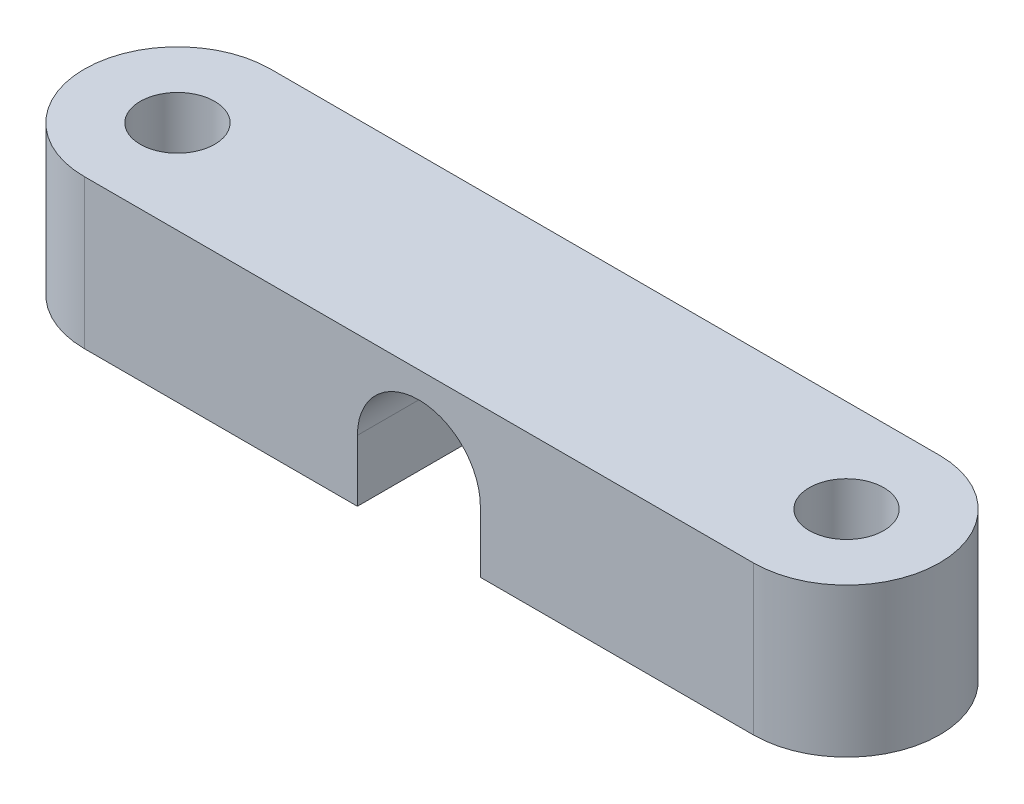
ISO-10303-21;
HEADER;
FILE_DESCRIPTION(('STEP AP214'),'2;1');
FILE_NAME('part.step','',(''),(''),'','','');
FILE_SCHEMA(('AUTOMOTIVE_DESIGN { 1 0 10303 214 1 1 1 1 }'));
ENDSEC;
DATA;
#1=APPLICATION_CONTEXT('core data for automotive mechanical design processes');
#2=APPLICATION_PROTOCOL_DEFINITION('international standard','automotive_design',2000,#1);
#3=PRODUCT_CONTEXT('',#1,'mechanical');
#4=PRODUCT('Part','Part','',(#3));
#5=PRODUCT_RELATED_PRODUCT_CATEGORY('part','',(#4));
#6=PRODUCT_DEFINITION_FORMATION('','',#4);
#7=PRODUCT_DEFINITION_CONTEXT('part definition',#1,'design');
#8=PRODUCT_DEFINITION('design','',#6,#7);
#9=PRODUCT_DEFINITION_SHAPE('','',#8);
#10=(LENGTH_UNIT() NAMED_UNIT(*) SI_UNIT(.MILLI.,.METRE.));
#11=(NAMED_UNIT(*) PLANE_ANGLE_UNIT() SI_UNIT($,.RADIAN.));
#12=(NAMED_UNIT(*) SI_UNIT($,.STERADIAN.) SOLID_ANGLE_UNIT());
#13=UNCERTAINTY_MEASURE_WITH_UNIT(LENGTH_MEASURE(1.E-05),#10,'distance_accuracy_value','');
#14=(GEOMETRIC_REPRESENTATION_CONTEXT(3) GLOBAL_UNCERTAINTY_ASSIGNED_CONTEXT((#13)) GLOBAL_UNIT_ASSIGNED_CONTEXT((#10,
#11,#12)) REPRESENTATION_CONTEXT('',''));
#15=CARTESIAN_POINT('',(0.,0.,0.));
#16=DIRECTION('',(0.,0.,1.));
#17=DIRECTION('',(1.,0.,0.));
#18=AXIS2_PLACEMENT_3D('',#15,#16,#17);
#19=CARTESIAN_POINT('',(-17.9605122421383,0.,-17.9605122421383));
#20=DIRECTION('',(0.,1.,0.));
#21=DIRECTION('',(0.,0.,1.));
#22=AXIS2_PLACEMENT_3D('',#19,#20,#21);
#23=PLANE('',#22);
#24=CARTESIAN_POINT('',(17.9605122421383,0.,-17.9605122421383));
#25=DIRECTION('',(0.,1.,0.));
#26=DIRECTION('',(0.,0.,1.));
#27=AXIS2_PLACEMENT_3D('',#24,#25,#26);
#28=CIRCLE('',#27,2.);
#29=CARTESIAN_POINT('',(17.9605122421383,0.,-15.9605122421383));
#30=VERTEX_POINT('',#29);
#31=EDGE_CURVE('E161',#30,#30,#28,.T.);
#32=ORIENTED_EDGE('',*,*,#31,.T.);
#33=EDGE_LOOP('',(#32));
#34=FACE_BOUND('',#33,.T.);
#35=DIRECTION('',(0.,0.,1.));
#36=VECTOR('',#35,1.);
#37=CARTESIAN_POINT('',(3.29999999999998,0.,-22.9605122421383));
#38=LINE('',#37,#36);
#39=CARTESIAN_POINT('',(3.29999999999998,0.,-22.9605122421383));
#40=VERTEX_POINT('',#39);
#41=CARTESIAN_POINT('',(3.29999999999998,0.,-12.9605122421383));
#42=VERTEX_POINT('',#41);
#43=EDGE_CURVE('E112',#40,#42,#38,.T.);
#44=ORIENTED_EDGE('',*,*,#43,.F.);
#45=DIRECTION('',(-1.,0.,0.));
#46=VECTOR('',#45,1.);
#47=CARTESIAN_POINT('',(-17.9605122421383,0.,-22.9605122421383));
#48=LINE('',#47,#46);
#49=CARTESIAN_POINT('',(17.9605122421383,0.,-22.9605122421383));
#50=VERTEX_POINT('',#49);
#51=EDGE_CURVE('E122',#50,#40,#48,.T.);
#52=ORIENTED_EDGE('',*,*,#51,.F.);
#53=CARTESIAN_POINT('',(17.9605122421383,0.,-17.9605122421383));
#54=DIRECTION('',(0.,1.,0.));
#55=DIRECTION('',(0.,0.,1.));
#56=AXIS2_PLACEMENT_3D('',#53,#54,#55);
#57=CIRCLE('',#56,5.);
#58=CARTESIAN_POINT('',(17.9605122421383,0.,-12.9605122421383));
#59=VERTEX_POINT('',#58);
#60=EDGE_CURVE('E133',#59,#50,#57,.T.);
#61=ORIENTED_EDGE('',*,*,#60,.F.);
#62=DIRECTION('',(1.,0.,0.));
#63=VECTOR('',#62,1.);
#64=CARTESIAN_POINT('',(-17.9605122421383,0.,-12.9605122421383));
#65=LINE('',#64,#63);
#66=EDGE_CURVE('E123',#42,#59,#65,.T.);
#67=ORIENTED_EDGE('',*,*,#66,.F.);
#68=EDGE_LOOP('',(#44,#52,#61,#67));
#69=FACE_BOUND('',#68,.T.);
#70=ADVANCED_FACE('F35',(#34,#69),#23,.F.);
#71=CARTESIAN_POINT('',(-17.9605122421383,8.,-17.9605122421383));
#72=DIRECTION('',(0.,1.,0.));
#73=DIRECTION('',(0.,0.,1.));
#74=AXIS2_PLACEMENT_3D('',#71,#72,#73);
#75=PLANE('',#74);
#76=CARTESIAN_POINT('',(-17.9605122421383,8.,-17.9605122421383));
#77=DIRECTION('',(0.,1.,0.));
#78=DIRECTION('',(0.,0.,1.));
#79=AXIS2_PLACEMENT_3D('',#76,#77,#78);
#80=CIRCLE('',#79,2.);
#81=CARTESIAN_POINT('',(-17.9605122421383,8.,-15.9605122421383));
#82=VERTEX_POINT('',#81);
#83=EDGE_CURVE('E151',#82,#82,#80,.T.);
#84=ORIENTED_EDGE('',*,*,#83,.F.);
#85=EDGE_LOOP('',(#84));
#86=FACE_BOUND('',#85,.T.);
#87=CARTESIAN_POINT('',(-17.9605122421383,8.,-17.9605122421383));
#88=DIRECTION('',(0.,1.,0.));
#89=DIRECTION('',(0.,0.,1.));
#90=AXIS2_PLACEMENT_3D('',#87,#88,#89);
#91=CIRCLE('',#90,5.);
#92=CARTESIAN_POINT('',(-17.9605122421383,8.,-22.9605122421383));
#93=VERTEX_POINT('',#92);
#94=CARTESIAN_POINT('',(-17.9605122421383,8.,-12.9605122421383));
#95=VERTEX_POINT('',#94);
#96=EDGE_CURVE('E130',#93,#95,#91,.T.);
#97=ORIENTED_EDGE('',*,*,#96,.T.);
#98=DIRECTION('',(1.,0.,0.));
#99=VECTOR('',#98,1.);
#100=CARTESIAN_POINT('',(-17.9605122421383,8.,-12.9605122421383));
#101=LINE('',#100,#99);
#102=CARTESIAN_POINT('',(17.9605122421383,8.,-12.9605122421383));
#103=VERTEX_POINT('',#102);
#104=EDGE_CURVE('E87',#95,#103,#101,.T.);
#105=ORIENTED_EDGE('',*,*,#104,.T.);
#106=CARTESIAN_POINT('',(17.9605122421383,8.,-17.9605122421383));
#107=DIRECTION('',(0.,1.,0.));
#108=DIRECTION('',(0.,0.,1.));
#109=AXIS2_PLACEMENT_3D('',#106,#107,#108);
#110=CIRCLE('',#109,5.);
#111=CARTESIAN_POINT('',(17.9605122421383,8.,-22.9605122421383));
#112=VERTEX_POINT('',#111);
#113=EDGE_CURVE('E143',#103,#112,#110,.T.);
#114=ORIENTED_EDGE('',*,*,#113,.T.);
#115=DIRECTION('',(-1.,0.,0.));
#116=VECTOR('',#115,1.);
#117=CARTESIAN_POINT('',(-17.9605122421383,8.,-22.9605122421383));
#118=LINE('',#117,#116);
#119=EDGE_CURVE('E59',#112,#93,#118,.T.);
#120=ORIENTED_EDGE('',*,*,#119,.T.);
#121=EDGE_LOOP('',(#97,#105,#114,#120));
#122=FACE_BOUND('',#121,.T.);
#123=CARTESIAN_POINT('',(17.9605122421383,8.,-17.9605122421383));
#124=DIRECTION('',(0.,1.,0.));
#125=DIRECTION('',(0.,0.,1.));
#126=AXIS2_PLACEMENT_3D('',#123,#124,#125);
#127=CIRCLE('',#126,2.);
#128=CARTESIAN_POINT('',(17.9605122421383,8.,-15.9605122421383));
#129=VERTEX_POINT('',#128);
#130=EDGE_CURVE('E158',#129,#129,#127,.T.);
#131=ORIENTED_EDGE('',*,*,#130,.F.);
#132=EDGE_LOOP('',(#131));
#133=FACE_BOUND('',#132,.T.);
#134=ADVANCED_FACE('F188',(#86,#122,#133),#75,.T.);
#135=CARTESIAN_POINT('',(-3.30000000000002,0.,-22.9605122421383));
#136=VERTEX_POINT('',#135);
#137=CARTESIAN_POINT('',(-17.9605122421383,0.,-22.9605122421383));
#138=VERTEX_POINT('',#137);
#139=EDGE_CURVE('E80',#136,#138,#48,.T.);
#140=ORIENTED_EDGE('',*,*,#139,.F.);
#141=DIRECTION('',(0.,0.,1.));
#142=VECTOR('',#141,1.);
#143=CARTESIAN_POINT('',(-3.30000000000002,0.,-22.9605122421383));
#144=LINE('',#143,#142);
#145=CARTESIAN_POINT('',(-3.30000000000002,0.,-12.9605122421383));
#146=VERTEX_POINT('',#145);
#147=EDGE_CURVE('E164',#136,#146,#144,.T.);
#148=ORIENTED_EDGE('',*,*,#147,.T.);
#149=CARTESIAN_POINT('',(-17.9605122421383,0.,-12.9605122421383));
#150=VERTEX_POINT('',#149);
#151=EDGE_CURVE('E144',#150,#146,#65,.T.);
#152=ORIENTED_EDGE('',*,*,#151,.F.);
#153=CARTESIAN_POINT('',(-17.9605122421383,0.,-17.9605122421383));
#154=DIRECTION('',(0.,1.,0.));
#155=DIRECTION('',(0.,0.,1.));
#156=AXIS2_PLACEMENT_3D('',#153,#154,#155);
#157=CIRCLE('',#156,5.);
#158=EDGE_CURVE('E147',#138,#150,#157,.T.);
#159=ORIENTED_EDGE('',*,*,#158,.F.);
#160=EDGE_LOOP('',(#140,#148,#152,#159));
#161=FACE_BOUND('',#160,.T.);
#162=CARTESIAN_POINT('',(-17.9605122421383,0.,-17.9605122421383));
#163=DIRECTION('',(0.,1.,0.));
#164=DIRECTION('',(0.,0.,1.));
#165=AXIS2_PLACEMENT_3D('',#162,#163,#164);
#166=CIRCLE('',#165,2.);
#167=CARTESIAN_POINT('',(-17.9605122421383,0.,-15.9605122421383));
#168=VERTEX_POINT('',#167);
#169=EDGE_CURVE('E155',#168,#168,#166,.T.);
#170=ORIENTED_EDGE('',*,*,#169,.T.);
#171=EDGE_LOOP('',(#170));
#172=FACE_BOUND('',#171,.T.);
#173=ADVANCED_FACE('F183',(#161,#172),#23,.F.);
#174=CARTESIAN_POINT('',(-17.9605122421383,8.,-17.9605122421383));
#175=DIRECTION('',(0.,-1.,0.));
#176=DIRECTION('',(0.,0.,-1.));
#177=AXIS2_PLACEMENT_3D('',#174,#175,#176);
#178=CYLINDRICAL_SURFACE('',#177,5.);
#179=ORIENTED_EDGE('',*,*,#158,.T.);
#180=DIRECTION('',(0.,-1.,0.));
#181=VECTOR('',#180,1.);
#182=CARTESIAN_POINT('',(-17.9605122421383,8.,-12.9605122421383));
#183=LINE('',#182,#181);
#184=EDGE_CURVE('E12',#95,#150,#183,.T.);
#185=ORIENTED_EDGE('',*,*,#184,.F.);
#186=ORIENTED_EDGE('',*,*,#96,.F.);
#187=DIRECTION('',(0.,-1.,0.));
#188=VECTOR('',#187,1.);
#189=CARTESIAN_POINT('',(-17.9605122421383,8.,-22.9605122421383));
#190=LINE('',#189,#188);
#191=EDGE_CURVE('E137',#93,#138,#190,.T.);
#192=ORIENTED_EDGE('',*,*,#191,.T.);
#193=EDGE_LOOP('',(#179,#185,#186,#192));
#194=FACE_BOUND('',#193,.T.);
#195=ADVANCED_FACE('F37',(#194),#178,.T.);
#196=CARTESIAN_POINT('',(-17.9605122421383,8.,-12.9605122421383));
#197=DIRECTION('',(0.,0.,-1.));
#198=DIRECTION('',(-1.,0.,0.));
#199=AXIS2_PLACEMENT_3D('',#196,#197,#198);
#200=PLANE('',#199);
#201=ORIENTED_EDGE('',*,*,#151,.T.);
#202=DIRECTION('',(0.,-1.,0.));
#203=VECTOR('',#202,1.);
#204=CARTESIAN_POINT('',(-3.30000000000002,0.,-12.9605122421383));
#205=LINE('',#204,#203);
#206=CARTESIAN_POINT('',(-3.30000000000002,3.3,-12.9605122421383));
#207=VERTEX_POINT('',#206);
#208=EDGE_CURVE('E116',#207,#146,#205,.T.);
#209=ORIENTED_EDGE('',*,*,#208,.F.);
#210=CARTESIAN_POINT('',(0.,3.3,-12.9605122421383));
#211=DIRECTION('',(0.,0.,1.));
#212=DIRECTION('',(1.,0.,0.));
#213=AXIS2_PLACEMENT_3D('',#210,#211,#212);
#214=CIRCLE('',#213,3.3);
#215=CARTESIAN_POINT('',(3.29999999999998,3.3,-12.9605122421383));
#216=VERTEX_POINT('',#215);
#217=EDGE_CURVE('E173',#216,#207,#214,.T.);
#218=ORIENTED_EDGE('',*,*,#217,.F.);
#219=DIRECTION('',(0.,-1.,0.));
#220=VECTOR('',#219,1.);
#221=CARTESIAN_POINT('',(3.29999999999998,0.,-12.9605122421383));
#222=LINE('',#221,#220);
#223=EDGE_CURVE('E176',#216,#42,#222,.T.);
#224=ORIENTED_EDGE('',*,*,#223,.T.);
#225=ORIENTED_EDGE('',*,*,#66,.T.);
#226=DIRECTION('',(0.,-1.,0.));
#227=VECTOR('',#226,1.);
#228=CARTESIAN_POINT('',(17.9605122421383,8.,-12.9605122421383));
#229=LINE('',#228,#227);
#230=EDGE_CURVE('E43',#103,#59,#229,.T.);
#231=ORIENTED_EDGE('',*,*,#230,.F.);
#232=ORIENTED_EDGE('',*,*,#104,.F.);
#233=ORIENTED_EDGE('',*,*,#184,.T.);
#234=EDGE_LOOP('',(#201,#209,#218,#224,#225,#231,#232,#233));
#235=FACE_BOUND('',#234,.T.);
#236=ADVANCED_FACE('F212',(#235),#200,.F.);
#237=CARTESIAN_POINT('',(17.9605122421383,8.,-17.9605122421383));
#238=DIRECTION('',(0.,-1.,0.));
#239=DIRECTION('',(0.,0.,-1.));
#240=AXIS2_PLACEMENT_3D('',#237,#238,#239);
#241=CYLINDRICAL_SURFACE('',#240,5.);
#242=ORIENTED_EDGE('',*,*,#60,.T.);
#243=DIRECTION('',(0.,-1.,0.));
#244=VECTOR('',#243,1.);
#245=CARTESIAN_POINT('',(17.9605122421383,8.,-22.9605122421383));
#246=LINE('',#245,#244);
#247=EDGE_CURVE('E129',#112,#50,#246,.T.);
#248=ORIENTED_EDGE('',*,*,#247,.F.);
#249=ORIENTED_EDGE('',*,*,#113,.F.);
#250=ORIENTED_EDGE('',*,*,#230,.T.);
#251=EDGE_LOOP('',(#242,#248,#249,#250));
#252=FACE_BOUND('',#251,.T.);
#253=ADVANCED_FACE('F142',(#252),#241,.T.);
#254=CARTESIAN_POINT('',(-17.9605122421383,8.,-22.9605122421383));
#255=DIRECTION('',(0.,0.,1.));
#256=DIRECTION('',(1.,0.,0.));
#257=AXIS2_PLACEMENT_3D('',#254,#255,#256);
#258=PLANE('',#257);
#259=CARTESIAN_POINT('',(0.,3.3,-22.9605122421383));
#260=DIRECTION('',(0.,0.,1.));
#261=DIRECTION('',(1.,0.,0.));
#262=AXIS2_PLACEMENT_3D('',#259,#260,#261);
#263=CIRCLE('',#262,3.3);
#264=CARTESIAN_POINT('',(3.29999999999998,3.3,-22.9605122421383));
#265=VERTEX_POINT('',#264);
#266=CARTESIAN_POINT('',(-3.30000000000002,3.3,-22.9605122421383));
#267=VERTEX_POINT('',#266);
#268=EDGE_CURVE('E50',#265,#267,#263,.T.);
#269=ORIENTED_EDGE('',*,*,#268,.T.);
#270=DIRECTION('',(0.,-1.,0.));
#271=VECTOR('',#270,1.);
#272=CARTESIAN_POINT('',(-3.30000000000002,0.,-22.9605122421383));
#273=LINE('',#272,#271);
#274=EDGE_CURVE('E124',#267,#136,#273,.T.);
#275=ORIENTED_EDGE('',*,*,#274,.T.);
#276=ORIENTED_EDGE('',*,*,#139,.T.);
#277=ORIENTED_EDGE('',*,*,#191,.F.);
#278=ORIENTED_EDGE('',*,*,#119,.F.);
#279=ORIENTED_EDGE('',*,*,#247,.T.);
#280=ORIENTED_EDGE('',*,*,#51,.T.);
#281=DIRECTION('',(0.,-1.,0.));
#282=VECTOR('',#281,1.);
#283=CARTESIAN_POINT('',(3.29999999999998,0.,-22.9605122421383));
#284=LINE('',#283,#282);
#285=EDGE_CURVE('E108',#265,#40,#284,.T.);
#286=ORIENTED_EDGE('',*,*,#285,.F.);
#287=EDGE_LOOP('',(#269,#275,#276,#277,#278,#279,#280,#286));
#288=FACE_BOUND('',#287,.T.);
#289=ADVANCED_FACE('F127',(#288),#258,.F.);
#290=CARTESIAN_POINT('',(-17.9605122421383,8.,-17.9605122421383));
#291=DIRECTION('',(0.,-1.,0.));
#292=DIRECTION('',(0.,0.,-1.));
#293=AXIS2_PLACEMENT_3D('',#290,#291,#292);
#294=CYLINDRICAL_SURFACE('',#293,2.);
#295=ORIENTED_EDGE('',*,*,#83,.T.);
#296=EDGE_LOOP('',(#295));
#297=FACE_BOUND('',#296,.T.);
#298=ORIENTED_EDGE('',*,*,#169,.F.);
#299=EDGE_LOOP('',(#298));
#300=FACE_BOUND('',#299,.T.);
#301=ADVANCED_FACE('F199',(#297,#300),#294,.F.);
#302=CARTESIAN_POINT('',(17.9605122421383,8.,-17.9605122421383));
#303=DIRECTION('',(0.,-1.,0.));
#304=DIRECTION('',(0.,0.,-1.));
#305=AXIS2_PLACEMENT_3D('',#302,#303,#304);
#306=CYLINDRICAL_SURFACE('',#305,2.);
#307=ORIENTED_EDGE('',*,*,#130,.T.);
#308=EDGE_LOOP('',(#307));
#309=FACE_BOUND('',#308,.T.);
#310=ORIENTED_EDGE('',*,*,#31,.F.);
#311=EDGE_LOOP('',(#310));
#312=FACE_BOUND('',#311,.T.);
#313=ADVANCED_FACE('F195',(#309,#312),#306,.F.);
#314=CARTESIAN_POINT('',(-3.30000000000002,0.,-22.9605122421383));
#315=DIRECTION('',(-1.,0.,0.));
#316=DIRECTION('',(0.,0.,1.));
#317=AXIS2_PLACEMENT_3D('',#314,#315,#316);
#318=PLANE('',#317);
#319=ORIENTED_EDGE('',*,*,#208,.T.);
#320=ORIENTED_EDGE('',*,*,#147,.F.);
#321=ORIENTED_EDGE('',*,*,#274,.F.);
#322=DIRECTION('',(0.,0.,1.));
#323=VECTOR('',#322,1.);
#324=CARTESIAN_POINT('',(-3.30000000000002,3.3,-22.9605122421383));
#325=LINE('',#324,#323);
#326=EDGE_CURVE('E168',#267,#207,#325,.T.);
#327=ORIENTED_EDGE('',*,*,#326,.T.);
#328=EDGE_LOOP('',(#319,#320,#321,#327));
#329=FACE_BOUND('',#328,.T.);
#330=ADVANCED_FACE('F198',(#329),#318,.F.);
#331=CARTESIAN_POINT('',(0.,3.3,-22.9605122421383));
#332=DIRECTION('',(0.,0.,1.));
#333=DIRECTION('',(1.,0.,0.));
#334=AXIS2_PLACEMENT_3D('',#331,#332,#333);
#335=CYLINDRICAL_SURFACE('',#334,3.3);
#336=ORIENTED_EDGE('',*,*,#217,.T.);
#337=ORIENTED_EDGE('',*,*,#326,.F.);
#338=ORIENTED_EDGE('',*,*,#268,.F.);
#339=DIRECTION('',(0.,0.,1.));
#340=VECTOR('',#339,1.);
#341=CARTESIAN_POINT('',(3.29999999999998,3.3,-22.9605122421383));
#342=LINE('',#341,#340);
#343=EDGE_CURVE('E114',#265,#216,#342,.T.);
#344=ORIENTED_EDGE('',*,*,#343,.T.);
#345=EDGE_LOOP('',(#336,#337,#338,#344));
#346=FACE_BOUND('',#345,.T.);
#347=ADVANCED_FACE('F232',(#346),#335,.F.);
#348=CARTESIAN_POINT('',(3.29999999999998,0.,-22.9605122421383));
#349=DIRECTION('',(-1.,0.,0.));
#350=DIRECTION('',(0.,0.,1.));
#351=AXIS2_PLACEMENT_3D('',#348,#349,#350);
#352=PLANE('',#351);
#353=ORIENTED_EDGE('',*,*,#223,.F.);
#354=ORIENTED_EDGE('',*,*,#343,.F.);
#355=ORIENTED_EDGE('',*,*,#285,.T.);
#356=ORIENTED_EDGE('',*,*,#43,.T.);
#357=EDGE_LOOP('',(#353,#354,#355,#356));
#358=FACE_BOUND('',#357,.T.);
#359=ADVANCED_FACE('F111',(#358),#352,.T.);
#360=CLOSED_SHELL('',(#70,#134,#173,#195,#236,#253,#289,#301,#313,#330,#347,#359));
#361=MANIFOLD_SOLID_BREP('B2',#360);
#362=ADVANCED_BREP_SHAPE_REPRESENTATION('',(#18,#361),#14);
#363=SHAPE_DEFINITION_REPRESENTATION(#9,#362);
ENDSEC;
END-ISO-10303-21;
